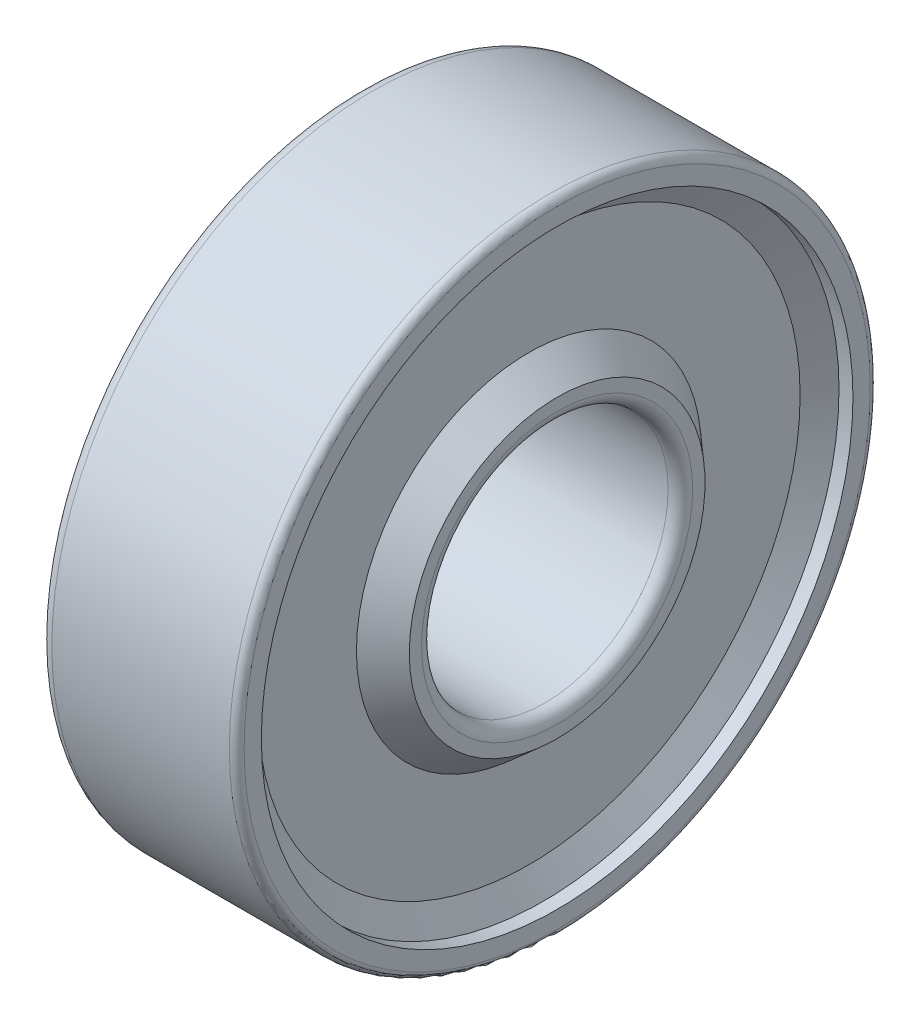
ISO-10303-21;
HEADER;
FILE_DESCRIPTION(('STEP AP214'),'2;1');
FILE_NAME('part.step','',(''),(''),'','','');
FILE_SCHEMA(('AUTOMOTIVE_DESIGN { 1 0 10303 214 1 1 1 1 }'));
ENDSEC;
DATA;
#1=APPLICATION_CONTEXT('core data for automotive mechanical design processes');
#2=APPLICATION_PROTOCOL_DEFINITION('international standard','automotive_design',2000,#1);
#3=PRODUCT_CONTEXT('',#1,'mechanical');
#4=PRODUCT('Part','Part','',(#3));
#5=PRODUCT_RELATED_PRODUCT_CATEGORY('part','',(#4));
#6=PRODUCT_DEFINITION_FORMATION('','',#4);
#7=PRODUCT_DEFINITION_CONTEXT('part definition',#1,'design');
#8=PRODUCT_DEFINITION('design','',#6,#7);
#9=PRODUCT_DEFINITION_SHAPE('','',#8);
#10=(LENGTH_UNIT() NAMED_UNIT(*) SI_UNIT(.MILLI.,.METRE.));
#11=(NAMED_UNIT(*) PLANE_ANGLE_UNIT() SI_UNIT($,.RADIAN.));
#12=(NAMED_UNIT(*) SI_UNIT($,.STERADIAN.) SOLID_ANGLE_UNIT());
#13=UNCERTAINTY_MEASURE_WITH_UNIT(LENGTH_MEASURE(1.E-05),#10,'distance_accuracy_value','');
#14=(GEOMETRIC_REPRESENTATION_CONTEXT(3) GLOBAL_UNCERTAINTY_ASSIGNED_CONTEXT((#13)) GLOBAL_UNIT_ASSIGNED_CONTEXT((#10,
#11,#12)) REPRESENTATION_CONTEXT('',''));
#15=CARTESIAN_POINT('',(0.,0.,0.));
#16=DIRECTION('',(0.,0.,1.));
#17=DIRECTION('',(1.,0.,0.));
#18=AXIS2_PLACEMENT_3D('',#15,#16,#17);
#19=CARTESIAN_POINT('',(-3.5,0.,0.));
#20=DIRECTION('',(-1.,0.,0.));
#21=DIRECTION('',(0.,0.,1.));
#22=AXIS2_PLACEMENT_3D('',#19,#20,#21);
#23=TOROIDAL_SURFACE('',#22,12.5,0.500000000000001);
#24=CARTESIAN_POINT('',(-4.,0.,0.));
#25=DIRECTION('',(-1.,0.,0.));
#26=DIRECTION('',(0.,0.,1.));
#27=AXIS2_PLACEMENT_3D('',#24,#25,#26);
#28=CIRCLE('',#27,12.5);
#29=CARTESIAN_POINT('',(-4.,0.,12.5));
#30=VERTEX_POINT('',#29);
#31=EDGE_CURVE('E10',#30,#30,#28,.T.);
#32=ORIENTED_EDGE('',*,*,#31,.F.);
#33=EDGE_LOOP('',(#32));
#34=FACE_BOUND('',#33,.T.);
#35=CARTESIAN_POINT('',(-3.50000000000006,0.,0.));
#36=DIRECTION('',(-1.,0.,0.));
#37=DIRECTION('',(0.,0.,1.));
#38=AXIS2_PLACEMENT_3D('',#35,#36,#37);
#39=CIRCLE('',#38,13.);
#40=CARTESIAN_POINT('',(-3.50000000000006,0.,13.));
#41=VERTEX_POINT('',#40);
#42=EDGE_CURVE('E89',#41,#41,#39,.T.);
#43=ORIENTED_EDGE('',*,*,#42,.T.);
#44=EDGE_LOOP('',(#43));
#45=FACE_BOUND('',#44,.T.);
#46=ADVANCED_FACE('F34',(#34,#45),#23,.T.);
#47=CARTESIAN_POINT('',(-4.00000000000001,12.5,0.));
#48=DIRECTION('',(1.,0.,0.));
#49=DIRECTION('',(0.,0.,-1.));
#50=AXIS2_PLACEMENT_3D('',#47,#48,#49);
#51=PLANE('',#50);
#52=CARTESIAN_POINT('',(-4.,0.,0.));
#53=DIRECTION('',(-1.,0.,0.));
#54=DIRECTION('',(0.,0.,1.));
#55=AXIS2_PLACEMENT_3D('',#52,#53,#54);
#56=CIRCLE('',#55,12.);
#57=CARTESIAN_POINT('',(-4.,0.,12.));
#58=VERTEX_POINT('',#57);
#59=EDGE_CURVE('E40',#58,#58,#56,.T.);
#60=ORIENTED_EDGE('',*,*,#59,.F.);
#61=EDGE_LOOP('',(#60));
#62=FACE_BOUND('',#61,.T.);
#63=ORIENTED_EDGE('',*,*,#31,.T.);
#64=EDGE_LOOP('',(#63));
#65=FACE_BOUND('',#64,.T.);
#66=ADVANCED_FACE('F180',(#62,#65),#51,.F.);
#67=CARTESIAN_POINT('',(-4.,0.,0.));
#68=DIRECTION('',(-1.,0.,0.));
#69=DIRECTION('',(0.,0.,1.));
#70=AXIS2_PLACEMENT_3D('',#67,#68,#69);
#71=CONICAL_SURFACE('',#70,12.,0.718829999621638);
#72=CARTESIAN_POINT('',(-2.85714285714289,0.,0.));
#73=DIRECTION('',(-1.,0.,0.));
#74=DIRECTION('',(0.,0.,1.));
#75=AXIS2_PLACEMENT_3D('',#72,#73,#74);
#76=CIRCLE('',#75,11.);
#77=CARTESIAN_POINT('',(-2.85714285714289,0.,11.));
#78=VERTEX_POINT('',#77);
#79=EDGE_CURVE('E44',#78,#78,#76,.T.);
#80=ORIENTED_EDGE('',*,*,#79,.F.);
#81=EDGE_LOOP('',(#80));
#82=FACE_BOUND('',#81,.T.);
#83=ORIENTED_EDGE('',*,*,#59,.T.);
#84=EDGE_LOOP('',(#83));
#85=FACE_BOUND('',#84,.T.);
#86=ADVANCED_FACE('F175',(#82,#85),#71,.F.);
#87=CARTESIAN_POINT('',(-2.85714285714285,11.,0.));
#88=DIRECTION('',(1.,0.,0.));
#89=DIRECTION('',(0.,0.,-1.));
#90=AXIS2_PLACEMENT_3D('',#87,#88,#89);
#91=PLANE('',#90);
#92=CARTESIAN_POINT('',(-2.85714285714289,0.,0.));
#93=DIRECTION('',(-1.,0.,0.));
#94=DIRECTION('',(0.,0.,1.));
#95=AXIS2_PLACEMENT_3D('',#92,#93,#94);
#96=CIRCLE('',#95,6.99999999999999);
#97=CARTESIAN_POINT('',(-2.85714285714289,0.,6.99999999999999));
#98=VERTEX_POINT('',#97);
#99=EDGE_CURVE('E48',#98,#98,#96,.T.);
#100=ORIENTED_EDGE('',*,*,#99,.F.);
#101=EDGE_LOOP('',(#100));
#102=FACE_BOUND('',#101,.T.);
#103=ORIENTED_EDGE('',*,*,#79,.T.);
#104=EDGE_LOOP('',(#103));
#105=FACE_BOUND('',#104,.T.);
#106=ADVANCED_FACE('F169',(#102,#105),#91,.F.);
#107=CARTESIAN_POINT('',(-2.85714285714289,0.,0.));
#108=DIRECTION('',(1.,0.,0.));
#109=DIRECTION('',(0.,0.,-1.));
#110=AXIS2_PLACEMENT_3D('',#107,#108,#109);
#111=CONICAL_SURFACE('',#110,6.99999999999999,0.718829999621637);
#112=CARTESIAN_POINT('',(-4.,0.,0.));
#113=DIRECTION('',(-1.,0.,0.));
#114=DIRECTION('',(0.,0.,1.));
#115=AXIS2_PLACEMENT_3D('',#112,#113,#114);
#116=CIRCLE('',#115,5.99999999999999);
#117=CARTESIAN_POINT('',(-4.,0.,5.99999999999999));
#118=VERTEX_POINT('',#117);
#119=EDGE_CURVE('E53',#118,#118,#116,.T.);
#120=ORIENTED_EDGE('',*,*,#119,.F.);
#121=EDGE_LOOP('',(#120));
#122=FACE_BOUND('',#121,.T.);
#123=ORIENTED_EDGE('',*,*,#99,.T.);
#124=EDGE_LOOP('',(#123));
#125=FACE_BOUND('',#124,.T.);
#126=ADVANCED_FACE('F163',(#122,#125),#111,.T.);
#127=CARTESIAN_POINT('',(-4.00000000000001,5.99999999999999,0.));
#128=DIRECTION('',(1.,0.,0.));
#129=DIRECTION('',(0.,0.,-1.));
#130=AXIS2_PLACEMENT_3D('',#127,#128,#129);
#131=PLANE('',#130);
#132=CARTESIAN_POINT('',(-4.,0.,0.));
#133=DIRECTION('',(-1.,0.,0.));
#134=DIRECTION('',(0.,0.,1.));
#135=AXIS2_PLACEMENT_3D('',#132,#133,#134);
#136=CIRCLE('',#135,5.5);
#137=CARTESIAN_POINT('',(-4.,0.,5.5));
#138=VERTEX_POINT('',#137);
#139=EDGE_CURVE('E56',#138,#138,#136,.T.);
#140=ORIENTED_EDGE('',*,*,#139,.F.);
#141=EDGE_LOOP('',(#140));
#142=FACE_BOUND('',#141,.T.);
#143=ORIENTED_EDGE('',*,*,#119,.T.);
#144=EDGE_LOOP('',(#143));
#145=FACE_BOUND('',#144,.T.);
#146=ADVANCED_FACE('F157',(#142,#145),#131,.F.);
#147=CARTESIAN_POINT('',(-3.50000000000001,0.,0.));
#148=DIRECTION('',(-1.,0.,0.));
#149=DIRECTION('',(0.,0.,1.));
#150=AXIS2_PLACEMENT_3D('',#147,#148,#149);
#151=TOROIDAL_SURFACE('',#150,5.5,0.5);
#152=CARTESIAN_POINT('',(-3.50000000000006,0.,0.));
#153=DIRECTION('',(-1.,0.,0.));
#154=DIRECTION('',(0.,0.,1.));
#155=AXIS2_PLACEMENT_3D('',#152,#153,#154);
#156=CIRCLE('',#155,5.);
#157=CARTESIAN_POINT('',(-3.50000000000006,0.,5.));
#158=VERTEX_POINT('',#157);
#159=EDGE_CURVE('E59',#158,#158,#156,.T.);
#160=ORIENTED_EDGE('',*,*,#159,.F.);
#161=EDGE_LOOP('',(#160));
#162=FACE_BOUND('',#161,.T.);
#163=ORIENTED_EDGE('',*,*,#139,.T.);
#164=EDGE_LOOP('',(#163));
#165=FACE_BOUND('',#164,.T.);
#166=ADVANCED_FACE('F151',(#162,#165),#151,.T.);
#167=CARTESIAN_POINT('',(-1000.,0.,0.));
#168=DIRECTION('',(-1.,0.,0.));
#169=DIRECTION('',(0.,0.,1.));
#170=AXIS2_PLACEMENT_3D('',#167,#168,#169);
#171=CYLINDRICAL_SURFACE('',#170,5.);
#172=CARTESIAN_POINT('',(3.50000000000006,0.,0.));
#173=DIRECTION('',(-1.,0.,0.));
#174=DIRECTION('',(0.,0.,1.));
#175=AXIS2_PLACEMENT_3D('',#172,#173,#174);
#176=CIRCLE('',#175,5.);
#177=CARTESIAN_POINT('',(3.50000000000006,0.,5.));
#178=VERTEX_POINT('',#177);
#179=EDGE_CURVE('E62',#178,#178,#176,.T.);
#180=ORIENTED_EDGE('',*,*,#179,.F.);
#181=EDGE_LOOP('',(#180));
#182=FACE_BOUND('',#181,.T.);
#183=ORIENTED_EDGE('',*,*,#159,.T.);
#184=EDGE_LOOP('',(#183));
#185=FACE_BOUND('',#184,.T.);
#186=ADVANCED_FACE('F145',(#182,#185),#171,.F.);
#187=CARTESIAN_POINT('',(3.50000000000001,0.,0.));
#188=DIRECTION('',(-1.,0.,0.));
#189=DIRECTION('',(0.,0.,1.));
#190=AXIS2_PLACEMENT_3D('',#187,#188,#189);
#191=TOROIDAL_SURFACE('',#190,5.5,0.5);
#192=CARTESIAN_POINT('',(4.,0.,0.));
#193=DIRECTION('',(-1.,0.,0.));
#194=DIRECTION('',(0.,0.,1.));
#195=AXIS2_PLACEMENT_3D('',#192,#193,#194);
#196=CIRCLE('',#195,5.5);
#197=CARTESIAN_POINT('',(4.,0.,5.5));
#198=VERTEX_POINT('',#197);
#199=EDGE_CURVE('E65',#198,#198,#196,.T.);
#200=ORIENTED_EDGE('',*,*,#199,.F.);
#201=EDGE_LOOP('',(#200));
#202=FACE_BOUND('',#201,.T.);
#203=ORIENTED_EDGE('',*,*,#179,.T.);
#204=EDGE_LOOP('',(#203));
#205=FACE_BOUND('',#204,.T.);
#206=ADVANCED_FACE('F139',(#202,#205),#191,.T.);
#207=CARTESIAN_POINT('',(4.00000000000001,5.99999999999999,0.));
#208=DIRECTION('',(-1.,0.,0.));
#209=DIRECTION('',(0.,0.,1.));
#210=AXIS2_PLACEMENT_3D('',#207,#208,#209);
#211=PLANE('',#210);
#212=CARTESIAN_POINT('',(4.,0.,0.));
#213=DIRECTION('',(-1.,0.,0.));
#214=DIRECTION('',(0.,0.,1.));
#215=AXIS2_PLACEMENT_3D('',#212,#213,#214);
#216=CIRCLE('',#215,5.99999999999999);
#217=CARTESIAN_POINT('',(4.,0.,5.99999999999999));
#218=VERTEX_POINT('',#217);
#219=EDGE_CURVE('E68',#218,#218,#216,.T.);
#220=ORIENTED_EDGE('',*,*,#219,.F.);
#221=EDGE_LOOP('',(#220));
#222=FACE_BOUND('',#221,.T.);
#223=ORIENTED_EDGE('',*,*,#199,.T.);
#224=EDGE_LOOP('',(#223));
#225=FACE_BOUND('',#224,.T.);
#226=ADVANCED_FACE('F133',(#222,#225),#211,.F.);
#227=CARTESIAN_POINT('',(4.,0.,0.));
#228=DIRECTION('',(-1.,0.,0.));
#229=DIRECTION('',(0.,0.,1.));
#230=AXIS2_PLACEMENT_3D('',#227,#228,#229);
#231=CONICAL_SURFACE('',#230,5.99999999999999,0.718829999621637);
#232=CARTESIAN_POINT('',(2.85714285714289,0.,0.));
#233=DIRECTION('',(-1.,0.,0.));
#234=DIRECTION('',(0.,0.,1.));
#235=AXIS2_PLACEMENT_3D('',#232,#233,#234);
#236=CIRCLE('',#235,6.99999999999999);
#237=CARTESIAN_POINT('',(2.85714285714289,0.,6.99999999999999));
#238=VERTEX_POINT('',#237);
#239=EDGE_CURVE('E71',#238,#238,#236,.T.);
#240=ORIENTED_EDGE('',*,*,#239,.F.);
#241=EDGE_LOOP('',(#240));
#242=FACE_BOUND('',#241,.T.);
#243=ORIENTED_EDGE('',*,*,#219,.T.);
#244=EDGE_LOOP('',(#243));
#245=FACE_BOUND('',#244,.T.);
#246=ADVANCED_FACE('F127',(#242,#245),#231,.T.);
#247=CARTESIAN_POINT('',(2.85714285714285,11.,0.));
#248=DIRECTION('',(-1.,0.,0.));
#249=DIRECTION('',(0.,0.,1.));
#250=AXIS2_PLACEMENT_3D('',#247,#248,#249);
#251=PLANE('',#250);
#252=CARTESIAN_POINT('',(2.85714285714289,0.,0.));
#253=DIRECTION('',(-1.,0.,0.));
#254=DIRECTION('',(0.,0.,1.));
#255=AXIS2_PLACEMENT_3D('',#252,#253,#254);
#256=CIRCLE('',#255,11.);
#257=CARTESIAN_POINT('',(2.85714285714289,0.,11.));
#258=VERTEX_POINT('',#257);
#259=EDGE_CURVE('E74',#258,#258,#256,.T.);
#260=ORIENTED_EDGE('',*,*,#259,.F.);
#261=EDGE_LOOP('',(#260));
#262=FACE_BOUND('',#261,.T.);
#263=ORIENTED_EDGE('',*,*,#239,.T.);
#264=EDGE_LOOP('',(#263));
#265=FACE_BOUND('',#264,.T.);
#266=ADVANCED_FACE('F121',(#262,#265),#251,.F.);
#267=CARTESIAN_POINT('',(2.85714285714289,0.,0.));
#268=DIRECTION('',(1.,0.,0.));
#269=DIRECTION('',(0.,0.,-1.));
#270=AXIS2_PLACEMENT_3D('',#267,#268,#269);
#271=CONICAL_SURFACE('',#270,11.,1.04719755119671);
#272=CARTESIAN_POINT('',(3.43449312633237,0.,0.));
#273=DIRECTION('',(-1.,0.,0.));
#274=DIRECTION('',(0.,0.,1.));
#275=AXIS2_PLACEMENT_3D('',#272,#273,#274);
#276=CIRCLE('',#275,12.);
#277=CARTESIAN_POINT('',(3.43449312633237,0.,12.));
#278=VERTEX_POINT('',#277);
#279=EDGE_CURVE('E77',#278,#278,#276,.T.);
#280=ORIENTED_EDGE('',*,*,#279,.F.);
#281=EDGE_LOOP('',(#280));
#282=FACE_BOUND('',#281,.T.);
#283=ORIENTED_EDGE('',*,*,#259,.T.);
#284=EDGE_LOOP('',(#283));
#285=FACE_BOUND('',#284,.T.);
#286=ADVANCED_FACE('F115',(#282,#285),#271,.F.);
#287=CARTESIAN_POINT('',(-1000.,0.,0.));
#288=DIRECTION('',(-1.,0.,0.));
#289=DIRECTION('',(0.,0.,1.));
#290=AXIS2_PLACEMENT_3D('',#287,#288,#289);
#291=CYLINDRICAL_SURFACE('',#290,12.);
#292=CARTESIAN_POINT('',(4.,0.,0.));
#293=DIRECTION('',(-1.,0.,0.));
#294=DIRECTION('',(0.,0.,1.));
#295=AXIS2_PLACEMENT_3D('',#292,#293,#294);
#296=CIRCLE('',#295,12.);
#297=CARTESIAN_POINT('',(4.,0.,12.));
#298=VERTEX_POINT('',#297);
#299=EDGE_CURVE('E80',#298,#298,#296,.T.);
#300=ORIENTED_EDGE('',*,*,#299,.F.);
#301=EDGE_LOOP('',(#300));
#302=FACE_BOUND('',#301,.T.);
#303=ORIENTED_EDGE('',*,*,#279,.T.);
#304=EDGE_LOOP('',(#303));
#305=FACE_BOUND('',#304,.T.);
#306=ADVANCED_FACE('F109',(#302,#305),#291,.F.);
#307=CARTESIAN_POINT('',(4.00000000000001,12.7,0.));
#308=DIRECTION('',(-1.,0.,0.));
#309=DIRECTION('',(0.,0.,1.));
#310=AXIS2_PLACEMENT_3D('',#307,#308,#309);
#311=PLANE('',#310);
#312=CARTESIAN_POINT('',(4.,0.,0.));
#313=DIRECTION('',(-1.,0.,0.));
#314=DIRECTION('',(0.,0.,1.));
#315=AXIS2_PLACEMENT_3D('',#312,#313,#314);
#316=CIRCLE('',#315,12.7);
#317=CARTESIAN_POINT('',(4.,0.,12.7));
#318=VERTEX_POINT('',#317);
#319=EDGE_CURVE('E83',#318,#318,#316,.T.);
#320=ORIENTED_EDGE('',*,*,#319,.F.);
#321=EDGE_LOOP('',(#320));
#322=FACE_BOUND('',#321,.T.);
#323=ORIENTED_EDGE('',*,*,#299,.T.);
#324=EDGE_LOOP('',(#323));
#325=FACE_BOUND('',#324,.T.);
#326=ADVANCED_FACE('F103',(#322,#325),#311,.F.);
#327=CARTESIAN_POINT('',(3.70000000000001,0.,0.));
#328=DIRECTION('',(-1.,0.,0.));
#329=DIRECTION('',(0.,0.,1.));
#330=AXIS2_PLACEMENT_3D('',#327,#328,#329);
#331=TOROIDAL_SURFACE('',#330,12.7,0.300000000000001);
#332=CARTESIAN_POINT('',(3.70000000000004,0.,0.));
#333=DIRECTION('',(-1.,0.,0.));
#334=DIRECTION('',(0.,0.,1.));
#335=AXIS2_PLACEMENT_3D('',#332,#333,#334);
#336=CIRCLE('',#335,13.);
#337=CARTESIAN_POINT('',(3.70000000000004,0.,13.));
#338=VERTEX_POINT('',#337);
#339=EDGE_CURVE('E86',#338,#338,#336,.T.);
#340=ORIENTED_EDGE('',*,*,#339,.F.);
#341=EDGE_LOOP('',(#340));
#342=FACE_BOUND('',#341,.T.);
#343=ORIENTED_EDGE('',*,*,#319,.T.);
#344=EDGE_LOOP('',(#343));
#345=FACE_BOUND('',#344,.T.);
#346=ADVANCED_FACE('F97',(#342,#345),#331,.T.);
#347=CARTESIAN_POINT('',(-1000.,0.,0.));
#348=DIRECTION('',(-1.,0.,0.));
#349=DIRECTION('',(0.,0.,1.));
#350=AXIS2_PLACEMENT_3D('',#347,#348,#349);
#351=CYLINDRICAL_SURFACE('',#350,13.);
#352=ORIENTED_EDGE('',*,*,#42,.F.);
#353=EDGE_LOOP('',(#352));
#354=FACE_BOUND('',#353,.T.);
#355=ORIENTED_EDGE('',*,*,#339,.T.);
#356=EDGE_LOOP('',(#355));
#357=FACE_BOUND('',#356,.T.);
#358=ADVANCED_FACE('F94',(#354,#357),#351,.T.);
#359=CLOSED_SHELL('',(#46,#66,#86,#106,#126,#146,#166,#186,#206,#226,#246,#266,#286,#306,#326,
#346,#358));
#360=MANIFOLD_SOLID_BREP('B2',#359);
#361=ADVANCED_BREP_SHAPE_REPRESENTATION('',(#18,#360),#14);
#362=SHAPE_DEFINITION_REPRESENTATION(#9,#361);
ENDSEC;
END-ISO-10303-21;
